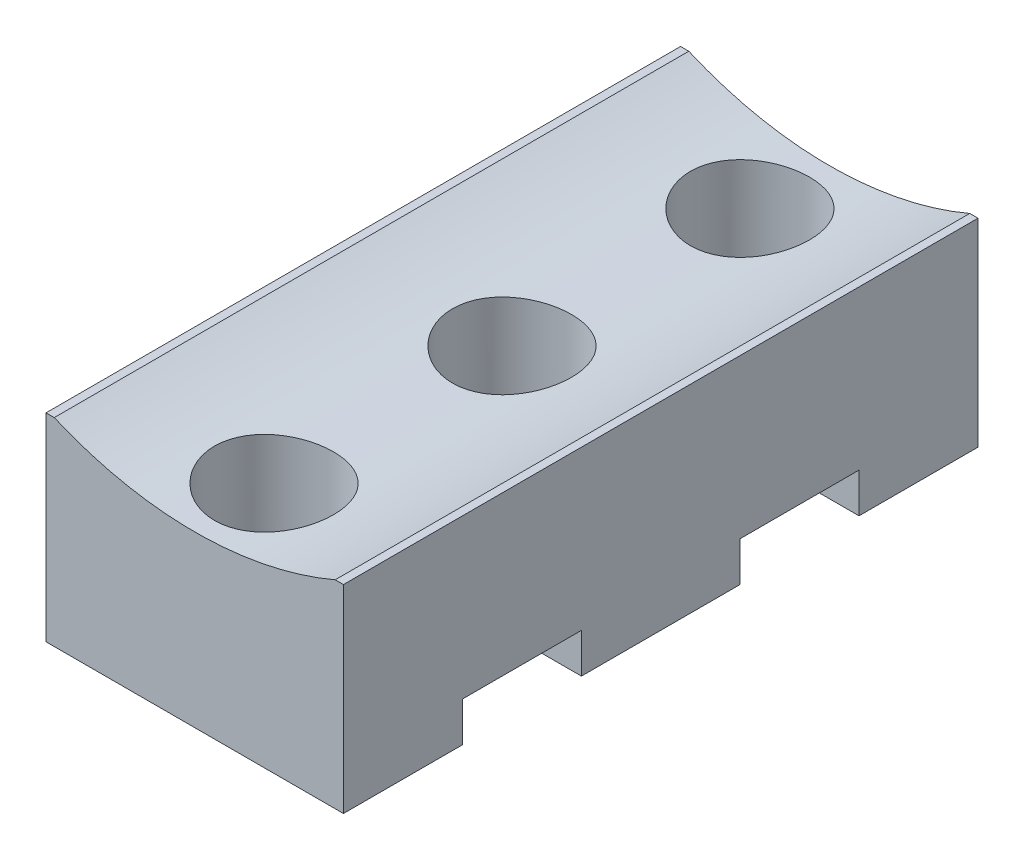
ISO-10303-21;
HEADER;
FILE_DESCRIPTION(('STEP AP214'),'2;1');
FILE_NAME('part.step','',(''),(''),'','','');
FILE_SCHEMA(('AUTOMOTIVE_DESIGN { 1 0 10303 214 1 1 1 1 }'));
ENDSEC;
DATA;
#1=APPLICATION_CONTEXT('core data for automotive mechanical design processes');
#2=APPLICATION_PROTOCOL_DEFINITION('international standard','automotive_design',2000,#1);
#3=PRODUCT_CONTEXT('',#1,'mechanical');
#4=PRODUCT('Part','Part','',(#3));
#5=PRODUCT_RELATED_PRODUCT_CATEGORY('part','',(#4));
#6=PRODUCT_DEFINITION_FORMATION('','',#4);
#7=PRODUCT_DEFINITION_CONTEXT('part definition',#1,'design');
#8=PRODUCT_DEFINITION('design','',#6,#7);
#9=PRODUCT_DEFINITION_SHAPE('','',#8);
#10=(LENGTH_UNIT() NAMED_UNIT(*) SI_UNIT(.MILLI.,.METRE.));
#11=(NAMED_UNIT(*) PLANE_ANGLE_UNIT() SI_UNIT($,.RADIAN.));
#12=(NAMED_UNIT(*) SI_UNIT($,.STERADIAN.) SOLID_ANGLE_UNIT());
#13=UNCERTAINTY_MEASURE_WITH_UNIT(LENGTH_MEASURE(1.E-05),#10,'distance_accuracy_value','');
#14=(GEOMETRIC_REPRESENTATION_CONTEXT(3) GLOBAL_UNCERTAINTY_ASSIGNED_CONTEXT((#13)) GLOBAL_UNIT_ASSIGNED_CONTEXT((#10,
#11,#12)) REPRESENTATION_CONTEXT('',''));
#15=CARTESIAN_POINT('',(0.,0.,0.));
#16=DIRECTION('',(0.,0.,1.));
#17=DIRECTION('',(1.,0.,0.));
#18=AXIS2_PLACEMENT_3D('',#15,#16,#17);
#19=CARTESIAN_POINT('',(-7.5,2.,-12.));
#20=DIRECTION('',(0.,0.,-1.));
#21=DIRECTION('',(-1.,0.,0.));
#22=AXIS2_PLACEMENT_3D('',#19,#20,#21);
#23=PLANE('',#22);
#24=DIRECTION('',(0.,1.,0.));
#25=VECTOR('',#24,1.);
#26=CARTESIAN_POINT('',(-7.5,10.,-12.));
#27=LINE('',#26,#25);
#28=CARTESIAN_POINT('',(-7.5,0.,-12.));
#29=VERTEX_POINT('',#28);
#30=CARTESIAN_POINT('',(-7.5,2.,-12.));
#31=VERTEX_POINT('',#30);
#32=EDGE_CURVE('E139',#29,#31,#27,.T.);
#33=ORIENTED_EDGE('',*,*,#32,.F.);
#34=DIRECTION('',(1.,0.,0.));
#35=VECTOR('',#34,1.);
#36=CARTESIAN_POINT('',(-7.5,0.,-12.));
#37=LINE('',#36,#35);
#38=CARTESIAN_POINT('',(7.5,0.,-12.));
#39=VERTEX_POINT('',#38);
#40=EDGE_CURVE('E138',#39,#29,#37,.F.);
#41=ORIENTED_EDGE('',*,*,#40,.F.);
#42=DIRECTION('',(0.,1.,0.));
#43=VECTOR('',#42,1.);
#44=CARTESIAN_POINT('',(7.5,10.,-12.));
#45=LINE('',#44,#43);
#46=CARTESIAN_POINT('',(7.5,2.,-12.));
#47=VERTEX_POINT('',#46);
#48=EDGE_CURVE('E125',#47,#39,#45,.F.);
#49=ORIENTED_EDGE('',*,*,#48,.F.);
#50=DIRECTION('',(1.,0.,0.));
#51=VECTOR('',#50,1.);
#52=CARTESIAN_POINT('',(-7.5,2.,-12.));
#53=LINE('',#52,#51);
#54=EDGE_CURVE('E166',#47,#31,#53,.F.);
#55=ORIENTED_EDGE('',*,*,#54,.T.);
#56=EDGE_LOOP('',(#33,#41,#49,#55));
#57=FACE_BOUND('',#56,.T.);
#58=ADVANCED_FACE('F17',(#57),#23,.F.);
#59=CARTESIAN_POINT('',(-7.5,0.,-32.));
#60=DIRECTION('',(0.,-1.,0.));
#61=DIRECTION('',(0.,0.,-1.));
#62=AXIS2_PLACEMENT_3D('',#59,#60,#61);
#63=PLANE('',#62);
#64=CARTESIAN_POINT('',(0.,0.,-16.));
#65=DIRECTION('',(0.,-1.,0.));
#66=DIRECTION('',(0.,0.,-1.));
#67=AXIS2_PLACEMENT_3D('',#64,#65,#66);
#68=CIRCLE('',#67,1.5);
#69=CARTESIAN_POINT('',(0.,0.,-17.5));
#70=VERTEX_POINT('',#69);
#71=EDGE_CURVE('E20',#70,#70,#68,.F.);
#72=ORIENTED_EDGE('',*,*,#71,.T.);
#73=EDGE_LOOP('',(#72));
#74=FACE_BOUND('',#73,.T.);
#75=DIRECTION('',(1.,0.,0.));
#76=VECTOR('',#75,1.);
#77=CARTESIAN_POINT('',(-7.5,0.,-20.));
#78=LINE('',#77,#76);
#79=CARTESIAN_POINT('',(-7.5,0.,-20.));
#80=VERTEX_POINT('',#79);
#81=CARTESIAN_POINT('',(7.5,0.,-20.));
#82=VERTEX_POINT('',#81);
#83=EDGE_CURVE('E143',#80,#82,#78,.T.);
#84=ORIENTED_EDGE('',*,*,#83,.T.);
#85=DIRECTION('',(0.,0.,-1.));
#86=VECTOR('',#85,1.);
#87=CARTESIAN_POINT('',(7.5,0.,-32.));
#88=LINE('',#87,#86);
#89=EDGE_CURVE('E129',#39,#82,#88,.T.);
#90=ORIENTED_EDGE('',*,*,#89,.F.);
#91=ORIENTED_EDGE('',*,*,#40,.T.);
#92=DIRECTION('',(0.,0.,1.));
#93=VECTOR('',#92,1.);
#94=CARTESIAN_POINT('',(-7.5,0.,-32.));
#95=LINE('',#94,#93);
#96=EDGE_CURVE('E194',#80,#29,#95,.T.);
#97=ORIENTED_EDGE('',*,*,#96,.F.);
#98=EDGE_LOOP('',(#84,#90,#91,#97));
#99=FACE_BOUND('',#98,.T.);
#100=ADVANCED_FACE('F145',(#74,#99),#63,.T.);
#101=CARTESIAN_POINT('',(-7.5,2.,-20.));
#102=DIRECTION('',(0.,0.,1.));
#103=DIRECTION('',(1.,0.,0.));
#104=AXIS2_PLACEMENT_3D('',#101,#102,#103);
#105=PLANE('',#104);
#106=DIRECTION('',(0.,1.,0.));
#107=VECTOR('',#106,1.);
#108=CARTESIAN_POINT('',(-7.5,10.,-20.));
#109=LINE('',#108,#107);
#110=CARTESIAN_POINT('',(-7.5,2.,-20.));
#111=VERTEX_POINT('',#110);
#112=EDGE_CURVE('E198',#111,#80,#109,.F.);
#113=ORIENTED_EDGE('',*,*,#112,.F.);
#114=DIRECTION('',(1.,0.,0.));
#115=VECTOR('',#114,1.);
#116=CARTESIAN_POINT('',(-7.5,2.,-20.));
#117=LINE('',#116,#115);
#118=CARTESIAN_POINT('',(7.5,2.,-20.));
#119=VERTEX_POINT('',#118);
#120=EDGE_CURVE('E350',#111,#119,#117,.T.);
#121=ORIENTED_EDGE('',*,*,#120,.T.);
#122=DIRECTION('',(0.,1.,0.));
#123=VECTOR('',#122,1.);
#124=CARTESIAN_POINT('',(7.5,10.,-20.));
#125=LINE('',#124,#123);
#126=EDGE_CURVE('E147',#82,#119,#125,.T.);
#127=ORIENTED_EDGE('',*,*,#126,.F.);
#128=ORIENTED_EDGE('',*,*,#83,.F.);
#129=EDGE_LOOP('',(#113,#121,#127,#128));
#130=FACE_BOUND('',#129,.T.);
#131=ADVANCED_FACE('F309',(#130),#105,.F.);
#132=CARTESIAN_POINT('',(-7.5,2.,-20.));
#133=DIRECTION('',(0.,1.,0.));
#134=DIRECTION('',(0.,0.,1.));
#135=AXIS2_PLACEMENT_3D('',#132,#133,#134);
#136=PLANE('',#135);
#137=DIRECTION('',(0.,0.,1.));
#138=VECTOR('',#137,1.);
#139=CARTESIAN_POINT('',(-7.5,2.,-32.));
#140=LINE('',#139,#138);
#141=CARTESIAN_POINT('',(-7.5,2.,-26.));
#142=VERTEX_POINT('',#141);
#143=EDGE_CURVE('E175',#142,#111,#140,.T.);
#144=ORIENTED_EDGE('',*,*,#143,.F.);
#145=DIRECTION('',(-1.,0.,0.));
#146=VECTOR('',#145,1.);
#147=CARTESIAN_POINT('',(-7.5,2.,-26.));
#148=LINE('',#147,#146);
#149=CARTESIAN_POINT('',(7.5,2.,-26.));
#150=VERTEX_POINT('',#149);
#151=EDGE_CURVE('E169',#142,#150,#148,.F.);
#152=ORIENTED_EDGE('',*,*,#151,.T.);
#153=DIRECTION('',(0.,0.,-1.));
#154=VECTOR('',#153,1.);
#155=CARTESIAN_POINT('',(7.5,2.,-32.));
#156=LINE('',#155,#154);
#157=EDGE_CURVE('E149',#119,#150,#156,.T.);
#158=ORIENTED_EDGE('',*,*,#157,.F.);
#159=ORIENTED_EDGE('',*,*,#120,.F.);
#160=EDGE_LOOP('',(#144,#152,#158,#159));
#161=FACE_BOUND('',#160,.T.);
#162=ADVANCED_FACE('F305',(#161),#136,.F.);
#163=CARTESIAN_POINT('',(-7.5,2.,-26.));
#164=DIRECTION('',(0.,0.,-1.));
#165=DIRECTION('',(-1.,0.,0.));
#166=AXIS2_PLACEMENT_3D('',#163,#164,#165);
#167=PLANE('',#166);
#168=DIRECTION('',(0.,1.,0.));
#169=VECTOR('',#168,1.);
#170=CARTESIAN_POINT('',(-7.5,10.,-26.));
#171=LINE('',#170,#169);
#172=CARTESIAN_POINT('',(-7.5,0.,-26.));
#173=VERTEX_POINT('',#172);
#174=EDGE_CURVE('E172',#173,#142,#171,.T.);
#175=ORIENTED_EDGE('',*,*,#174,.F.);
#176=DIRECTION('',(1.,0.,0.));
#177=VECTOR('',#176,1.);
#178=CARTESIAN_POINT('',(-7.5,0.,-26.));
#179=LINE('',#178,#177);
#180=CARTESIAN_POINT('',(7.5,0.,-26.));
#181=VERTEX_POINT('',#180);
#182=EDGE_CURVE('E338',#181,#173,#179,.F.);
#183=ORIENTED_EDGE('',*,*,#182,.F.);
#184=DIRECTION('',(0.,1.,0.));
#185=VECTOR('',#184,1.);
#186=CARTESIAN_POINT('',(7.5,10.,-26.));
#187=LINE('',#186,#185);
#188=EDGE_CURVE('E343',#150,#181,#187,.F.);
#189=ORIENTED_EDGE('',*,*,#188,.F.);
#190=ORIENTED_EDGE('',*,*,#151,.F.);
#191=EDGE_LOOP('',(#175,#183,#189,#190));
#192=FACE_BOUND('',#191,.T.);
#193=ADVANCED_FACE('F301',(#192),#167,.F.);
#194=CARTESIAN_POINT('',(-7.5,2.,-6.));
#195=DIRECTION('',(0.,0.,1.));
#196=DIRECTION('',(0.,-1.,0.));
#197=AXIS2_PLACEMENT_3D('',#194,#195,#196);
#198=PLANE('',#197);
#199=DIRECTION('',(0.,1.,0.));
#200=VECTOR('',#199,1.);
#201=CARTESIAN_POINT('',(-7.5,10.,-6.));
#202=LINE('',#201,#200);
#203=CARTESIAN_POINT('',(-7.5,2.,-6.));
#204=VERTEX_POINT('',#203);
#205=CARTESIAN_POINT('',(-7.5,0.,-6.));
#206=VERTEX_POINT('',#205);
#207=EDGE_CURVE('E179',#204,#206,#202,.F.);
#208=ORIENTED_EDGE('',*,*,#207,.F.);
#209=DIRECTION('',(1.,0.,0.));
#210=VECTOR('',#209,1.);
#211=CARTESIAN_POINT('',(-7.5,2.,-6.));
#212=LINE('',#211,#210);
#213=CARTESIAN_POINT('',(7.5,2.,-6.));
#214=VERTEX_POINT('',#213);
#215=EDGE_CURVE('E168',#204,#214,#212,.T.);
#216=ORIENTED_EDGE('',*,*,#215,.T.);
#217=DIRECTION('',(0.,1.,0.));
#218=VECTOR('',#217,1.);
#219=CARTESIAN_POINT('',(7.5,10.,-6.));
#220=LINE('',#219,#218);
#221=CARTESIAN_POINT('',(7.5,0.,-6.));
#222=VERTEX_POINT('',#221);
#223=EDGE_CURVE('E163',#222,#214,#220,.T.);
#224=ORIENTED_EDGE('',*,*,#223,.F.);
#225=DIRECTION('',(1.,0.,0.));
#226=VECTOR('',#225,1.);
#227=CARTESIAN_POINT('',(-7.5,0.,-6.));
#228=LINE('',#227,#226);
#229=EDGE_CURVE('E321',#206,#222,#228,.T.);
#230=ORIENTED_EDGE('',*,*,#229,.F.);
#231=EDGE_LOOP('',(#208,#216,#224,#230));
#232=FACE_BOUND('',#231,.T.);
#233=ADVANCED_FACE('F297',(#232),#198,.F.);
#234=CARTESIAN_POINT('',(-7.5,2.,-6.));
#235=DIRECTION('',(0.,1.,0.));
#236=DIRECTION('',(0.,0.,1.));
#237=AXIS2_PLACEMENT_3D('',#234,#235,#236);
#238=PLANE('',#237);
#239=DIRECTION('',(0.,0.,1.));
#240=VECTOR('',#239,1.);
#241=CARTESIAN_POINT('',(-7.5,2.,-32.));
#242=LINE('',#241,#240);
#243=EDGE_CURVE('E182',#31,#204,#242,.T.);
#244=ORIENTED_EDGE('',*,*,#243,.F.);
#245=ORIENTED_EDGE('',*,*,#54,.F.);
#246=DIRECTION('',(0.,0.,-1.));
#247=VECTOR('',#246,1.);
#248=CARTESIAN_POINT('',(7.5,2.,-32.));
#249=LINE('',#248,#247);
#250=EDGE_CURVE('E132',#214,#47,#249,.T.);
#251=ORIENTED_EDGE('',*,*,#250,.F.);
#252=ORIENTED_EDGE('',*,*,#215,.F.);
#253=EDGE_LOOP('',(#244,#245,#251,#252));
#254=FACE_BOUND('',#253,.T.);
#255=ADVANCED_FACE('F293',(#254),#238,.F.);
#256=CARTESIAN_POINT('',(0.,10.,-16.));
#257=DIRECTION('',(0.,-1.,0.));
#258=DIRECTION('',(0.,0.,-1.));
#259=AXIS2_PLACEMENT_3D('',#256,#257,#258);
#260=CYLINDRICAL_SURFACE('',#259,1.5);
#261=ORIENTED_EDGE('',*,*,#71,.F.);
#262=EDGE_LOOP('',(#261));
#263=FACE_BOUND('',#262,.T.);
#264=CARTESIAN_POINT('',(0.,4.,-16.));
#265=DIRECTION('',(0.,-1.,0.));
#266=DIRECTION('',(0.,0.,-1.));
#267=AXIS2_PLACEMENT_3D('',#264,#265,#266);
#268=CIRCLE('',#267,1.5);
#269=CARTESIAN_POINT('',(0.,4.,-17.5));
#270=VERTEX_POINT('',#269);
#271=EDGE_CURVE('E162',#270,#270,#268,.T.);
#272=ORIENTED_EDGE('',*,*,#271,.F.);
#273=EDGE_LOOP('',(#272));
#274=FACE_BOUND('',#273,.T.);
#275=ADVANCED_FACE('F289',(#263,#274),#260,.F.);
#276=CARTESIAN_POINT('',(0.,10.,-28.));
#277=DIRECTION('',(0.,-1.,0.));
#278=DIRECTION('',(0.,0.,-1.));
#279=AXIS2_PLACEMENT_3D('',#276,#277,#278);
#280=CYLINDRICAL_SURFACE('',#279,1.5);
#281=CARTESIAN_POINT('',(0.,0.,-28.));
#282=DIRECTION('',(0.,-1.,0.));
#283=DIRECTION('',(0.,0.,-1.));
#284=AXIS2_PLACEMENT_3D('',#281,#282,#283);
#285=CIRCLE('',#284,1.5);
#286=CARTESIAN_POINT('',(0.,0.,-29.5));
#287=VERTEX_POINT('',#286);
#288=EDGE_CURVE('E135',#287,#287,#285,.F.);
#289=ORIENTED_EDGE('',*,*,#288,.F.);
#290=EDGE_LOOP('',(#289));
#291=FACE_BOUND('',#290,.T.);
#292=CARTESIAN_POINT('',(0.,4.,-28.));
#293=DIRECTION('',(0.,-1.,0.));
#294=DIRECTION('',(0.,0.,-1.));
#295=AXIS2_PLACEMENT_3D('',#292,#293,#294);
#296=CIRCLE('',#295,1.5);
#297=CARTESIAN_POINT('',(0.,4.,-29.5));
#298=VERTEX_POINT('',#297);
#299=EDGE_CURVE('E420',#298,#298,#296,.T.);
#300=ORIENTED_EDGE('',*,*,#299,.F.);
#301=EDGE_LOOP('',(#300));
#302=FACE_BOUND('',#301,.T.);
#303=ADVANCED_FACE('F285',(#291,#302),#280,.F.);
#304=CARTESIAN_POINT('',(0.,10.,-4.));
#305=DIRECTION('',(0.,-1.,0.));
#306=DIRECTION('',(0.,0.,-1.));
#307=AXIS2_PLACEMENT_3D('',#304,#305,#306);
#308=CYLINDRICAL_SURFACE('',#307,1.5);
#309=CARTESIAN_POINT('',(0.,0.,-4.));
#310=DIRECTION('',(0.,-1.,0.));
#311=DIRECTION('',(0.,0.,-1.));
#312=AXIS2_PLACEMENT_3D('',#309,#310,#311);
#313=CIRCLE('',#312,1.5);
#314=CARTESIAN_POINT('',(0.,0.,-5.5));
#315=VERTEX_POINT('',#314);
#316=EDGE_CURVE('E176',#315,#315,#313,.F.);
#317=ORIENTED_EDGE('',*,*,#316,.F.);
#318=EDGE_LOOP('',(#317));
#319=FACE_BOUND('',#318,.T.);
#320=CARTESIAN_POINT('',(0.,4.,-4.));
#321=DIRECTION('',(0.,-1.,0.));
#322=DIRECTION('',(0.,0.,-1.));
#323=AXIS2_PLACEMENT_3D('',#320,#321,#322);
#324=CIRCLE('',#323,1.5);
#325=CARTESIAN_POINT('',(0.,4.,-5.5));
#326=VERTEX_POINT('',#325);
#327=EDGE_CURVE('E417',#326,#326,#324,.T.);
#328=ORIENTED_EDGE('',*,*,#327,.F.);
#329=EDGE_LOOP('',(#328));
#330=FACE_BOUND('',#329,.T.);
#331=ADVANCED_FACE('F281',(#319,#330),#308,.F.);
#332=CARTESIAN_POINT('',(-7.5,0.,-32.));
#333=DIRECTION('',(0.,-1.,0.));
#334=DIRECTION('',(0.,0.,-1.));
#335=AXIS2_PLACEMENT_3D('',#332,#333,#334);
#336=PLANE('',#335);
#337=ORIENTED_EDGE('',*,*,#316,.T.);
#338=EDGE_LOOP('',(#337));
#339=FACE_BOUND('',#338,.T.);
#340=ORIENTED_EDGE('',*,*,#229,.T.);
#341=DIRECTION('',(0.,0.,-1.));
#342=VECTOR('',#341,1.);
#343=CARTESIAN_POINT('',(7.5,0.,-32.));
#344=LINE('',#343,#342);
#345=CARTESIAN_POINT('',(7.5,0.,0.));
#346=VERTEX_POINT('',#345);
#347=EDGE_CURVE('E335',#346,#222,#344,.T.);
#348=ORIENTED_EDGE('',*,*,#347,.F.);
#349=DIRECTION('',(1.,0.,0.));
#350=VECTOR('',#349,1.);
#351=CARTESIAN_POINT('',(-7.5,0.,0.));
#352=LINE('',#351,#350);
#353=CARTESIAN_POINT('',(-7.5,0.,0.));
#354=VERTEX_POINT('',#353);
#355=EDGE_CURVE('E397',#354,#346,#352,.T.);
#356=ORIENTED_EDGE('',*,*,#355,.F.);
#357=DIRECTION('',(0.,0.,1.));
#358=VECTOR('',#357,1.);
#359=CARTESIAN_POINT('',(-7.5,0.,-32.));
#360=LINE('',#359,#358);
#361=EDGE_CURVE('E181',#206,#354,#360,.T.);
#362=ORIENTED_EDGE('',*,*,#361,.F.);
#363=EDGE_LOOP('',(#340,#348,#356,#362));
#364=FACE_BOUND('',#363,.T.);
#365=ADVANCED_FACE('F277',(#339,#364),#336,.T.);
#366=CARTESIAN_POINT('',(-7.5,10.,-32.));
#367=DIRECTION('',(-1.,0.,0.));
#368=DIRECTION('',(0.,0.,1.));
#369=AXIS2_PLACEMENT_3D('',#366,#367,#368);
#370=PLANE('',#369);
#371=DIRECTION('',(0.,1.,0.));
#372=VECTOR('',#371,1.);
#373=CARTESIAN_POINT('',(-7.5,0.,-32.));
#374=LINE('',#373,#372);
#375=CARTESIAN_POINT('',(-7.5,10.,-32.));
#376=VERTEX_POINT('',#375);
#377=CARTESIAN_POINT('',(-7.5,0.,-32.));
#378=VERTEX_POINT('',#377);
#379=EDGE_CURVE('E383',#376,#378,#374,.F.);
#380=ORIENTED_EDGE('',*,*,#379,.T.);
#381=DIRECTION('',(0.,0.,-1.));
#382=VECTOR('',#381,1.);
#383=CARTESIAN_POINT('',(-7.5,0.,-32.));
#384=LINE('',#383,#382);
#385=EDGE_CURVE('E340',#173,#378,#384,.T.);
#386=ORIENTED_EDGE('',*,*,#385,.F.);
#387=ORIENTED_EDGE('',*,*,#174,.T.);
#388=ORIENTED_EDGE('',*,*,#143,.T.);
#389=ORIENTED_EDGE('',*,*,#112,.T.);
#390=ORIENTED_EDGE('',*,*,#96,.T.);
#391=ORIENTED_EDGE('',*,*,#32,.T.);
#392=ORIENTED_EDGE('',*,*,#243,.T.);
#393=ORIENTED_EDGE('',*,*,#207,.T.);
#394=ORIENTED_EDGE('',*,*,#361,.T.);
#395=DIRECTION('',(0.,1.,0.));
#396=VECTOR('',#395,1.);
#397=CARTESIAN_POINT('',(-7.5,0.,0.));
#398=LINE('',#397,#396);
#399=CARTESIAN_POINT('',(-7.5,10.,0.));
#400=VERTEX_POINT('',#399);
#401=EDGE_CURVE('E400',#400,#354,#398,.F.);
#402=ORIENTED_EDGE('',*,*,#401,.F.);
#403=DIRECTION('',(0.,0.,1.));
#404=VECTOR('',#403,1.);
#405=CARTESIAN_POINT('',(-7.5,10.,-32.));
#406=LINE('',#405,#404);
#407=EDGE_CURVE('E394',#376,#400,#406,.T.);
#408=ORIENTED_EDGE('',*,*,#407,.F.);
#409=EDGE_LOOP('',(#380,#386,#387,#388,#389,#390,#391,#392,#393,#394,#402,#408));
#410=FACE_BOUND('',#409,.T.);
#411=ADVANCED_FACE('F273',(#410),#370,.T.);
#412=CARTESIAN_POINT('',(-7.5,0.,-32.));
#413=DIRECTION('',(0.,-1.,0.));
#414=DIRECTION('',(0.,0.,-1.));
#415=AXIS2_PLACEMENT_3D('',#412,#413,#414);
#416=PLANE('',#415);
#417=ORIENTED_EDGE('',*,*,#288,.T.);
#418=EDGE_LOOP('',(#417));
#419=FACE_BOUND('',#418,.T.);
#420=ORIENTED_EDGE('',*,*,#182,.T.);
#421=ORIENTED_EDGE('',*,*,#385,.T.);
#422=DIRECTION('',(1.,0.,0.));
#423=VECTOR('',#422,1.);
#424=CARTESIAN_POINT('',(-7.5,0.,-32.));
#425=LINE('',#424,#423);
#426=CARTESIAN_POINT('',(7.5,0.,-32.));
#427=VERTEX_POINT('',#426);
#428=EDGE_CURVE('E373',#378,#427,#425,.T.);
#429=ORIENTED_EDGE('',*,*,#428,.T.);
#430=DIRECTION('',(0.,0.,-1.));
#431=VECTOR('',#430,1.);
#432=CARTESIAN_POINT('',(7.5,0.,-32.));
#433=LINE('',#432,#431);
#434=EDGE_CURVE('E345',#181,#427,#433,.T.);
#435=ORIENTED_EDGE('',*,*,#434,.F.);
#436=EDGE_LOOP('',(#420,#421,#429,#435));
#437=FACE_BOUND('',#436,.T.);
#438=ADVANCED_FACE('F270',(#419,#437),#416,.T.);
#439=CARTESIAN_POINT('',(7.5,10.,-32.));
#440=DIRECTION('',(1.,0.,0.));
#441=DIRECTION('',(0.,0.,-1.));
#442=AXIS2_PLACEMENT_3D('',#439,#440,#441);
#443=PLANE('',#442);
#444=ORIENTED_EDGE('',*,*,#223,.T.);
#445=ORIENTED_EDGE('',*,*,#250,.T.);
#446=ORIENTED_EDGE('',*,*,#48,.T.);
#447=ORIENTED_EDGE('',*,*,#89,.T.);
#448=ORIENTED_EDGE('',*,*,#126,.T.);
#449=ORIENTED_EDGE('',*,*,#157,.T.);
#450=ORIENTED_EDGE('',*,*,#188,.T.);
#451=ORIENTED_EDGE('',*,*,#434,.T.);
#452=DIRECTION('',(0.,1.,0.));
#453=VECTOR('',#452,1.);
#454=CARTESIAN_POINT('',(7.5,0.,-32.));
#455=LINE('',#454,#453);
#456=CARTESIAN_POINT('',(7.5,10.,-32.));
#457=VERTEX_POINT('',#456);
#458=EDGE_CURVE('E382',#427,#457,#455,.T.);
#459=ORIENTED_EDGE('',*,*,#458,.T.);
#460=DIRECTION('',(0.,0.,1.));
#461=VECTOR('',#460,1.);
#462=CARTESIAN_POINT('',(7.5,10.,-32.));
#463=LINE('',#462,#461);
#464=CARTESIAN_POINT('',(7.5,10.,0.));
#465=VERTEX_POINT('',#464);
#466=EDGE_CURVE('E53',#465,#457,#463,.F.);
#467=ORIENTED_EDGE('',*,*,#466,.F.);
#468=DIRECTION('',(0.,1.,0.));
#469=VECTOR('',#468,1.);
#470=CARTESIAN_POINT('',(7.5,0.,0.));
#471=LINE('',#470,#469);
#472=EDGE_CURVE('E403',#346,#465,#471,.T.);
#473=ORIENTED_EDGE('',*,*,#472,.F.);
#474=ORIENTED_EDGE('',*,*,#347,.T.);
#475=EDGE_LOOP('',(#444,#445,#446,#447,#448,#449,#450,#451,#459,#467,#473,#474));
#476=FACE_BOUND('',#475,.T.);
#477=ADVANCED_FACE('F127',(#476),#443,.T.);
#478=CARTESIAN_POINT('',(0.,4.,-16.));
#479=DIRECTION('',(0.,1.,0.));
#480=DIRECTION('',(0.,0.,1.));
#481=AXIS2_PLACEMENT_3D('',#478,#479,#480);
#482=PLANE('',#481);
#483=CARTESIAN_POINT('',(0.,4.,-16.));
#484=DIRECTION('',(0.,1.,0.));
#485=DIRECTION('',(0.,0.,1.));
#486=AXIS2_PLACEMENT_3D('',#483,#484,#485);
#487=CIRCLE('',#486,3.);
#488=CARTESIAN_POINT('',(0.,4.,-13.));
#489=VERTEX_POINT('',#488);
#490=EDGE_CURVE('E434',#489,#489,#487,.T.);
#491=ORIENTED_EDGE('',*,*,#490,.T.);
#492=EDGE_LOOP('',(#491));
#493=FACE_BOUND('',#492,.T.);
#494=ORIENTED_EDGE('',*,*,#271,.T.);
#495=EDGE_LOOP('',(#494));
#496=FACE_BOUND('',#495,.T.);
#497=ADVANCED_FACE('F263',(#493,#496),#482,.T.);
#498=CARTESIAN_POINT('',(0.,4.,-28.));
#499=DIRECTION('',(0.,1.,0.));
#500=DIRECTION('',(0.,0.,1.));
#501=AXIS2_PLACEMENT_3D('',#498,#499,#500);
#502=PLANE('',#501);
#503=CARTESIAN_POINT('',(0.,4.,-28.));
#504=DIRECTION('',(0.,1.,0.));
#505=DIRECTION('',(0.,0.,1.));
#506=AXIS2_PLACEMENT_3D('',#503,#504,#505);
#507=CIRCLE('',#506,3.);
#508=CARTESIAN_POINT('',(0.,4.,-25.));
#509=VERTEX_POINT('',#508);
#510=EDGE_CURVE('E450',#509,#509,#507,.T.);
#511=ORIENTED_EDGE('',*,*,#510,.T.);
#512=EDGE_LOOP('',(#511));
#513=FACE_BOUND('',#512,.T.);
#514=ORIENTED_EDGE('',*,*,#299,.T.);
#515=EDGE_LOOP('',(#514));
#516=FACE_BOUND('',#515,.T.);
#517=ADVANCED_FACE('F259',(#513,#516),#502,.T.);
#518=CARTESIAN_POINT('',(0.,4.,-4.));
#519=DIRECTION('',(0.,1.,0.));
#520=DIRECTION('',(0.,0.,1.));
#521=AXIS2_PLACEMENT_3D('',#518,#519,#520);
#522=PLANE('',#521);
#523=CARTESIAN_POINT('',(0.,4.,-4.));
#524=DIRECTION('',(0.,1.,0.));
#525=DIRECTION('',(0.,0.,1.));
#526=AXIS2_PLACEMENT_3D('',#523,#524,#525);
#527=CIRCLE('',#526,3.);
#528=CARTESIAN_POINT('',(0.,4.,-1.));
#529=VERTEX_POINT('',#528);
#530=EDGE_CURVE('E448',#529,#529,#527,.T.);
#531=ORIENTED_EDGE('',*,*,#530,.T.);
#532=EDGE_LOOP('',(#531));
#533=FACE_BOUND('',#532,.T.);
#534=ORIENTED_EDGE('',*,*,#327,.T.);
#535=EDGE_LOOP('',(#534));
#536=FACE_BOUND('',#535,.T.);
#537=ADVANCED_FACE('F255',(#533,#536),#522,.T.);
#538=CARTESIAN_POINT('',(-7.5,0.,0.));
#539=DIRECTION('',(0.,0.,1.));
#540=DIRECTION('',(1.,0.,0.));
#541=AXIS2_PLACEMENT_3D('',#538,#539,#540);
#542=PLANE('',#541);
#543=ORIENTED_EDGE('',*,*,#401,.T.);
#544=ORIENTED_EDGE('',*,*,#355,.T.);
#545=ORIENTED_EDGE('',*,*,#472,.T.);
#546=DIRECTION('',(1.,0.,0.));
#547=VECTOR('',#546,1.);
#548=CARTESIAN_POINT('',(-7.5,10.,0.));
#549=LINE('',#548,#547);
#550=CARTESIAN_POINT('',(7.08413982391358,10.,0.));
#551=VERTEX_POINT('',#550);
#552=EDGE_CURVE('E432',#551,#465,#549,.T.);
#553=ORIENTED_EDGE('',*,*,#552,.F.);
#554=CARTESIAN_POINT('',(0.,26.5473551649574,0.));
#555=DIRECTION('',(0.,0.,1.));
#556=DIRECTION('',(1.,0.,0.));
#557=AXIS2_PLACEMENT_3D('',#554,#555,#556);
#558=CIRCLE('',#557,18.);
#559=CARTESIAN_POINT('',(-7.0841398239136,10.,0.));
#560=VERTEX_POINT('',#559);
#561=EDGE_CURVE('E46',#551,#560,#558,.F.);
#562=ORIENTED_EDGE('',*,*,#561,.T.);
#563=DIRECTION('',(1.,0.,0.));
#564=VECTOR('',#563,1.);
#565=CARTESIAN_POINT('',(-7.5,10.,0.));
#566=LINE('',#565,#564);
#567=EDGE_CURVE('E396',#400,#560,#566,.T.);
#568=ORIENTED_EDGE('',*,*,#567,.F.);
#569=EDGE_LOOP('',(#543,#544,#545,#553,#562,#568));
#570=FACE_BOUND('',#569,.T.);
#571=ADVANCED_FACE('F251',(#570),#542,.T.);
#572=CARTESIAN_POINT('',(-7.5,10.,-32.));
#573=DIRECTION('',(0.,1.,0.));
#574=DIRECTION('',(0.,0.,1.));
#575=AXIS2_PLACEMENT_3D('',#572,#573,#574);
#576=PLANE('',#575);
#577=DIRECTION('',(0.,0.,1.));
#578=VECTOR('',#577,1.);
#579=CARTESIAN_POINT('',(-7.08413982391361,10.,-32.));
#580=LINE('',#579,#578);
#581=CARTESIAN_POINT('',(-7.08413982391362,10.,-32.));
#582=VERTEX_POINT('',#581);
#583=EDGE_CURVE('E447',#560,#582,#580,.F.);
#584=ORIENTED_EDGE('',*,*,#583,.T.);
#585=DIRECTION('',(1.,0.,0.));
#586=VECTOR('',#585,1.);
#587=CARTESIAN_POINT('',(-7.5,10.,-32.));
#588=LINE('',#587,#586);
#589=EDGE_CURVE('E391',#582,#376,#588,.F.);
#590=ORIENTED_EDGE('',*,*,#589,.T.);
#591=ORIENTED_EDGE('',*,*,#407,.T.);
#592=ORIENTED_EDGE('',*,*,#567,.T.);
#593=EDGE_LOOP('',(#584,#590,#591,#592));
#594=FACE_BOUND('',#593,.T.);
#595=ADVANCED_FACE('F247',(#594),#576,.T.);
#596=CARTESIAN_POINT('',(-7.5,0.,-32.));
#597=DIRECTION('',(0.,0.,1.));
#598=DIRECTION('',(1.,0.,0.));
#599=AXIS2_PLACEMENT_3D('',#596,#597,#598);
#600=PLANE('',#599);
#601=DIRECTION('',(1.,0.,0.));
#602=VECTOR('',#601,1.);
#603=CARTESIAN_POINT('',(-7.5,10.,-32.));
#604=LINE('',#603,#602);
#605=CARTESIAN_POINT('',(7.08413982391358,10.,-32.));
#606=VERTEX_POINT('',#605);
#607=EDGE_CURVE('E35',#457,#606,#604,.F.);
#608=ORIENTED_EDGE('',*,*,#607,.F.);
#609=ORIENTED_EDGE('',*,*,#458,.F.);
#610=ORIENTED_EDGE('',*,*,#428,.F.);
#611=ORIENTED_EDGE('',*,*,#379,.F.);
#612=ORIENTED_EDGE('',*,*,#589,.F.);
#613=CARTESIAN_POINT('',(0.,26.5473551649574,-32.));
#614=DIRECTION('',(0.,0.,1.));
#615=DIRECTION('',(1.,0.,0.));
#616=AXIS2_PLACEMENT_3D('',#613,#614,#615);
#617=CIRCLE('',#616,18.);
#618=EDGE_CURVE('E232',#582,#606,#617,.T.);
#619=ORIENTED_EDGE('',*,*,#618,.T.);
#620=EDGE_LOOP('',(#608,#609,#610,#611,#612,#619));
#621=FACE_BOUND('',#620,.T.);
#622=ADVANCED_FACE('F244',(#621),#600,.F.);
#623=CARTESIAN_POINT('',(-7.5,10.,-32.));
#624=DIRECTION('',(0.,1.,0.));
#625=DIRECTION('',(0.,0.,1.));
#626=AXIS2_PLACEMENT_3D('',#623,#624,#625);
#627=PLANE('',#626);
#628=DIRECTION('',(0.,0.,1.));
#629=VECTOR('',#628,1.);
#630=CARTESIAN_POINT('',(7.08413982391358,9.99999999999999,-32.));
#631=LINE('',#630,#629);
#632=EDGE_CURVE('E231',#606,#551,#631,.T.);
#633=ORIENTED_EDGE('',*,*,#632,.T.);
#634=ORIENTED_EDGE('',*,*,#552,.T.);
#635=ORIENTED_EDGE('',*,*,#466,.T.);
#636=ORIENTED_EDGE('',*,*,#607,.T.);
#637=EDGE_LOOP('',(#633,#634,#635,#636));
#638=FACE_BOUND('',#637,.T.);
#639=ADVANCED_FACE('F239',(#638),#627,.T.);
#640=CARTESIAN_POINT('',(0.,4.,-16.));
#641=DIRECTION('',(0.,1.,0.));
#642=DIRECTION('',(0.,0.,1.));
#643=AXIS2_PLACEMENT_3D('',#640,#641,#642);
#644=CYLINDRICAL_SURFACE('',#643,3.);
#645=ORIENTED_EDGE('',*,*,#490,.F.);
#646=EDGE_LOOP('',(#645));
#647=FACE_BOUND('',#646,.T.);
#648=CARTESIAN_POINT('',(0.,8.54735516495738,-19.));
#649=CARTESIAN_POINT('',(-0.16710542284323,8.54735834709135,-18.9999923028094));
#650=CARTESIAN_POINT('',(-0.334424042029189,8.54970844693161,-18.9859787480497));
#651=CARTESIAN_POINT('',(-0.664494045351389,8.5588633976651,-18.9302838356979));
#652=CARTESIAN_POINT('',(-0.82723545879622,8.56567729023721,-18.8885463191645));
#653=CARTESIAN_POINT('',(-1.14314119468437,8.58299548491677,-18.7786942730759));
#654=CARTESIAN_POINT('',(-1.29631716297547,8.59349519215987,-18.7106125743309));
#655=CARTESIAN_POINT('',(-1.58900766651183,8.61702780400564,-18.5500813555517));
#656=CARTESIAN_POINT('',(-1.72852726627542,8.63005976411898,-18.4576409163695));
#657=CARTESIAN_POINT('',(-1.99136333148328,8.65735500071693,-18.2500566069408));
#658=CARTESIAN_POINT('',(-2.114529001916,8.67162796373741,-18.134723043427));
#659=CARTESIAN_POINT('',(-2.33986100785765,8.69972292621787,-17.8850293919352));
#660=CARTESIAN_POINT('',(-2.44202493235993,8.7135448737481,-17.7506671224432));
#661=CARTESIAN_POINT('',(-2.62304092141885,8.73926443241489,-17.4657142160876));
#662=CARTESIAN_POINT('',(-2.70174614001876,8.75114971901201,-17.3150290857772));
#663=CARTESIAN_POINT('',(-2.83267049877272,8.77151776121109,-17.0023471178294));
#664=CARTESIAN_POINT('',(-2.88489165705092,8.78000077606084,-16.8403511431654));
#665=CARTESIAN_POINT('',(-2.96089722010099,8.79250871760757,-16.5112238066986));
#666=CARTESIAN_POINT('',(-2.98493879561113,8.79657393642382,-16.3441533937045));
#667=CARTESIAN_POINT('',(-3.0047000769294,8.79990789882542,-16.0083039470999));
#668=CARTESIAN_POINT('',(-3.0004217403074,8.79917697393678,-15.839525032392));
#669=CARTESIAN_POINT('',(-2.96387419590981,8.7930380311965,-15.5068872455603));
#670=CARTESIAN_POINT('',(-2.93189413316011,8.7876783293092,-15.3429955829882));
#671=CARTESIAN_POINT('',(-2.84130423908959,8.77296129948874,-15.0229357052052));
#672=CARTESIAN_POINT('',(-2.78269327608059,8.76360380166905,-14.8667678185313));
#673=CARTESIAN_POINT('',(-2.64020997905779,8.74189299166439,-14.5657195812624));
#674=CARTESIAN_POINT('',(-2.55621676454527,8.72952540030056,-14.4208975146872));
#675=CARTESIAN_POINT('',(-2.3654459721648,8.70319906312256,-14.1473047194026));
#676=CARTESIAN_POINT('',(-2.25866831409136,8.68924031170728,-14.0185340471996));
#677=CARTESIAN_POINT('',(-2.02380534343713,8.66109394717297,-13.7790352857002));
#678=CARTESIAN_POINT('',(-1.89547581110703,8.64690562051358,-13.6685466624349));
#679=CARTESIAN_POINT('',(-1.62190403433714,8.62004956076082,-13.4705852030582));
#680=CARTESIAN_POINT('',(-1.47665426381957,8.6073825094535,-13.3831226657101));
#681=CARTESIAN_POINT('',(-1.1731012990415,8.58497698504446,-13.2336816670763));
#682=CARTESIAN_POINT('',(-1.01477711749248,8.57524334187558,-13.1717451741364));
#683=CARTESIAN_POINT('',(-0.689983674346995,8.55985365352399,-13.0755345141578));
#684=CARTESIAN_POINT('',(-0.523532375544592,8.55418901506511,-13.0412020321636));
#685=CARTESIAN_POINT('',(-0.296563335675103,8.54970055904292,-13.0141004072232));
#686=CARTESIAN_POINT('',(-0.237385086219341,8.54882291154432,-13.0088170139648));
#687=CARTESIAN_POINT('',(-0.118813543546896,8.54764964849881,-13.0017654403841));
#688=CARTESIAN_POINT('',(-0.0594202501510433,8.54735403343697,-12.9999972629913));
#689=CARTESIAN_POINT('',(0.167105422843226,8.54735834709135,-13.0000076971906));
#690=CARTESIAN_POINT('',(0.334424042029186,8.54970844693161,-13.0140212519503));
#691=CARTESIAN_POINT('',(0.664494045351385,8.5588633976651,-13.0697161643021));
#692=CARTESIAN_POINT('',(0.827235458796217,8.56567729023722,-13.1114536808355));
#693=CARTESIAN_POINT('',(1.14314119468437,8.58299548491677,-13.2213057269241));
#694=CARTESIAN_POINT('',(1.29631716297546,8.59349519215987,-13.2893874256691));
#695=CARTESIAN_POINT('',(1.58900766651183,8.61702780400564,-13.4499186444483));
#696=CARTESIAN_POINT('',(1.72852726627542,8.63005976411898,-13.5423590836305));
#697=CARTESIAN_POINT('',(1.99136333148328,8.65735500071694,-13.7499433930592));
#698=CARTESIAN_POINT('',(2.114529001916,8.67162796373741,-13.865276956573));
#699=CARTESIAN_POINT('',(2.33986100785765,8.69972292621787,-14.1149706080648));
#700=CARTESIAN_POINT('',(2.44202493235993,8.71354487374809,-14.2493328775568));
#701=CARTESIAN_POINT('',(2.62304092141885,8.73926443241489,-14.5342857839124));
#702=CARTESIAN_POINT('',(2.70174614001876,8.75114971901201,-14.6849709142228));
#703=CARTESIAN_POINT('',(2.83267049877271,8.77151776121109,-14.9976528821706));
#704=CARTESIAN_POINT('',(2.88489165705092,8.78000077606084,-15.1596488568346));
#705=CARTESIAN_POINT('',(2.96089722010098,8.79250871760757,-15.4887761933014));
#706=CARTESIAN_POINT('',(2.98493879561113,8.79657393642382,-15.6558466062955));
#707=CARTESIAN_POINT('',(3.0047000769294,8.79990789882542,-15.9916960529001));
#708=CARTESIAN_POINT('',(3.0004217403074,8.79917697393678,-16.160474967608));
#709=CARTESIAN_POINT('',(2.96387419590981,8.79303803119651,-16.4931127544397));
#710=CARTESIAN_POINT('',(2.93189413316011,8.78767832930921,-16.6570044170118));
#711=CARTESIAN_POINT('',(2.84130423908959,8.77296129948875,-16.9770642947948));
#712=CARTESIAN_POINT('',(2.78269327608059,8.76360380166905,-17.1332321814687));
#713=CARTESIAN_POINT('',(2.64020997905779,8.74189299166439,-17.4342804187376));
#714=CARTESIAN_POINT('',(2.55621676454528,8.72952540030056,-17.5791024853128));
#715=CARTESIAN_POINT('',(2.36544597216481,8.70319906312256,-17.8526952805974));
#716=CARTESIAN_POINT('',(2.25866831409136,8.68924031170728,-17.9814659528004));
#717=CARTESIAN_POINT('',(2.02380534343713,8.66109394717297,-18.2209647142997));
#718=CARTESIAN_POINT('',(1.89547581110703,8.64690562051358,-18.3314533375651));
#719=CARTESIAN_POINT('',(1.62190403433714,8.62004956076081,-18.5294147969418));
#720=CARTESIAN_POINT('',(1.47665426381957,8.60738250945349,-18.6168773342899));
#721=CARTESIAN_POINT('',(1.1731012990415,8.58497698504446,-18.7663183329238));
#722=CARTESIAN_POINT('',(1.01477711749248,8.57524334187558,-18.8282548258636));
#723=CARTESIAN_POINT('',(0.689983674346993,8.55985365352399,-18.9244654858422));
#724=CARTESIAN_POINT('',(0.52353237554459,8.55418901506512,-18.9587979678364));
#725=CARTESIAN_POINT('',(0.296563335675102,8.54970055904293,-18.9858995927768));
#726=CARTESIAN_POINT('',(0.23738508621934,8.54882291154432,-18.9911829860352));
#727=CARTESIAN_POINT('',(0.118813543546895,8.54764964849881,-18.9982345596159));
#728=CARTESIAN_POINT('',(0.0594202501510406,8.54735403343697,-19.0000027370087));
#729=CARTESIAN_POINT('',(0.,8.54735516495738,-19.));
#730=B_SPLINE_CURVE_WITH_KNOTS('',3,(#648,#649,#650,#651,#652,#653,#654,#655,#656,#657,#658,
#659,#660,#661,#662,#663,#664,#665,#666,#667,#668,#669,#670,#671,#672,#673,#674,#675,#676,#677,
#678,#679,#680,#681,#682,#683,#684,#685,#686,#687,#688,#689,#690,#691,#692,#693,#694,#695,#696,
#697,#698,#699,#700,#701,#702,#703,#704,#705,#706,#707,#708,#709,#710,#711,#712,#713,#714,#715,
#716,#717,#718,#719,#720,#721,#722,#723,#724,#725,#726,#727,#728,#729),.UNSPECIFIED.,.T.,.F.,(4,
2,2,2,2,2,2,2,2,2,2,2,2,2,2,2,2,2,2,2,2,2,2,2,2,2,2,2,2,2,2,2,2,2,2,2,2,2,2,2,4),(0.,
0.501089459672944,1.00319705741744,1.5046809203961,2.00597809580989,2.51161684162916,
3.017313602549,3.52611245134674,4.03487252309976,4.53895250945664,5.04299765243215,
5.54184421638019,6.04071198094687,6.54199403236405,7.04327784841655,7.55068159301107,
8.05831189748175,8.56677351844704,9.07415814362647,9.25233809566926,9.43051819620226,
9.93160765587521,10.4337152536197,10.9351991165984,11.4364962920121,11.9421350378314,
12.4478317987513,12.956630647549,13.465390719302,13.9694707056589,14.4735158486344,
14.9723624125824,15.4712301771491,15.9725122285663,16.4737960446188,16.9811997892133,
17.488830093684,17.9972917146493,18.5046763398287,18.6828562918715,18.8610363924045),.UNSPECIFIED.);
#731=CARTESIAN_POINT('',(0.,8.54735516495738,-19.));
#732=VERTEX_POINT('',#731);
#733=EDGE_CURVE('E225',#732,#732,#730,.T.);
#734=ORIENTED_EDGE('',*,*,#733,.T.);
#735=EDGE_LOOP('',(#734));
#736=FACE_BOUND('',#735,.T.);
#737=ADVANCED_FACE('F234',(#647,#736),#644,.F.);
#738=CARTESIAN_POINT('',(0.,4.,-28.));
#739=DIRECTION('',(0.,1.,0.));
#740=DIRECTION('',(0.,0.,1.));
#741=AXIS2_PLACEMENT_3D('',#738,#739,#740);
#742=CYLINDRICAL_SURFACE('',#741,3.);
#743=ORIENTED_EDGE('',*,*,#510,.F.);
#744=EDGE_LOOP('',(#743));
#745=FACE_BOUND('',#744,.T.);
#746=CARTESIAN_POINT('',(0.,8.54735516495738,-31.));
#747=CARTESIAN_POINT('',(-0.16710542284323,8.54735834709135,-30.9999923028094));
#748=CARTESIAN_POINT('',(-0.33442404202919,8.54970844693161,-30.9859787480497));
#749=CARTESIAN_POINT('',(-0.664494045351389,8.5588633976651,-30.9302838356979));
#750=CARTESIAN_POINT('',(-0.827235458796221,8.56567729023722,-30.8885463191645));
#751=CARTESIAN_POINT('',(-1.14314119468438,8.58299548491677,-30.7786942730759));
#752=CARTESIAN_POINT('',(-1.29631716297547,8.59349519215986,-30.7106125743309));
#753=CARTESIAN_POINT('',(-1.58900766651183,8.61702780400563,-30.5500813555517));
#754=CARTESIAN_POINT('',(-1.72852726627542,8.63005976411898,-30.4576409163695));
#755=CARTESIAN_POINT('',(-1.99136333148328,8.65735500071693,-30.2500566069408));
#756=CARTESIAN_POINT('',(-2.114529001916,8.67162796373741,-30.134723043427));
#757=CARTESIAN_POINT('',(-2.33986100785765,8.69972292621787,-29.8850293919352));
#758=CARTESIAN_POINT('',(-2.44202493235993,8.7135448737481,-29.7506671224432));
#759=CARTESIAN_POINT('',(-2.62304092141885,8.73926443241489,-29.4657142160876));
#760=CARTESIAN_POINT('',(-2.70174614001876,8.75114971901201,-29.3150290857772));
#761=CARTESIAN_POINT('',(-2.83267049877272,8.77151776121109,-29.0023471178294));
#762=CARTESIAN_POINT('',(-2.88489165705092,8.78000077606084,-28.8403511431654));
#763=CARTESIAN_POINT('',(-2.96089722010098,8.79250871760757,-28.5112238066986));
#764=CARTESIAN_POINT('',(-2.98493879561113,8.79657393642382,-28.3441533937045));
#765=CARTESIAN_POINT('',(-3.0047000769294,8.79990789882542,-28.0083039470999));
#766=CARTESIAN_POINT('',(-3.0004217403074,8.79917697393678,-27.8395250323919));
#767=CARTESIAN_POINT('',(-2.96387419590981,8.7930380311965,-27.5068872455603));
#768=CARTESIAN_POINT('',(-2.93189413316011,8.7876783293092,-27.3429955829881));
#769=CARTESIAN_POINT('',(-2.84130423908958,8.77296129948874,-27.0229357052052));
#770=CARTESIAN_POINT('',(-2.78269327608058,8.76360380166905,-26.8667678185313));
#771=CARTESIAN_POINT('',(-2.64020997905778,8.74189299166439,-26.5657195812624));
#772=CARTESIAN_POINT('',(-2.55621676454527,8.72952540030056,-26.4208975146872));
#773=CARTESIAN_POINT('',(-2.3654459721648,8.70319906312256,-26.1473047194026));
#774=CARTESIAN_POINT('',(-2.25866831409136,8.68924031170728,-26.0185340471996));
#775=CARTESIAN_POINT('',(-2.02380534343713,8.66109394717297,-25.7790352857002));
#776=CARTESIAN_POINT('',(-1.89547581110703,8.64690562051358,-25.6685466624349));
#777=CARTESIAN_POINT('',(-1.62190403433714,8.62004956076081,-25.4705852030582));
#778=CARTESIAN_POINT('',(-1.47665426381957,8.60738250945349,-25.3831226657101));
#779=CARTESIAN_POINT('',(-1.17310129904149,8.58497698504446,-25.2336816670763));
#780=CARTESIAN_POINT('',(-1.01477711749248,8.57524334187558,-25.1717451741364));
#781=CARTESIAN_POINT('',(-0.689983674346989,8.55985365352399,-25.0755345141578));
#782=CARTESIAN_POINT('',(-0.523532375544587,8.55418901506512,-25.0412020321636));
#783=CARTESIAN_POINT('',(-0.2965633356751,8.54970055904293,-25.0141004072232));
#784=CARTESIAN_POINT('',(-0.237385086219339,8.54882291154432,-25.0088170139648));
#785=CARTESIAN_POINT('',(-0.118813543546896,8.54764964849881,-25.0017654403841));
#786=CARTESIAN_POINT('',(-0.0594202501510432,8.54735403343697,-24.9999972629913));
#787=CARTESIAN_POINT('',(0.167105422843226,8.54735834709135,-25.0000076971906));
#788=CARTESIAN_POINT('',(0.334424042029186,8.54970844693161,-25.0140212519503));
#789=CARTESIAN_POINT('',(0.664494045351385,8.5588633976651,-25.0697161643021));
#790=CARTESIAN_POINT('',(0.827235458796217,8.56567729023721,-25.1114536808355));
#791=CARTESIAN_POINT('',(1.14314119468437,8.58299548491677,-25.2213057269241));
#792=CARTESIAN_POINT('',(1.29631716297546,8.59349519215987,-25.2893874256691));
#793=CARTESIAN_POINT('',(1.58900766651183,8.61702780400564,-25.4499186444483));
#794=CARTESIAN_POINT('',(1.72852726627542,8.63005976411898,-25.5423590836305));
#795=CARTESIAN_POINT('',(1.99136333148328,8.65735500071693,-25.7499433930592));
#796=CARTESIAN_POINT('',(2.114529001916,8.67162796373741,-25.865276956573));
#797=CARTESIAN_POINT('',(2.33986100785764,8.69972292621787,-26.1149706080648));
#798=CARTESIAN_POINT('',(2.44202493235993,8.7135448737481,-26.2493328775568));
#799=CARTESIAN_POINT('',(2.62304092141885,8.73926443241489,-26.5342857839124));
#800=CARTESIAN_POINT('',(2.70174614001876,8.75114971901201,-26.6849709142228));
#801=CARTESIAN_POINT('',(2.83267049877271,8.77151776121109,-26.9976528821706));
#802=CARTESIAN_POINT('',(2.88489165705091,8.78000077606084,-27.1596488568346));
#803=CARTESIAN_POINT('',(2.96089722010098,8.79250871760757,-27.4887761933014));
#804=CARTESIAN_POINT('',(2.98493879561113,8.79657393642382,-27.6558466062955));
#805=CARTESIAN_POINT('',(3.0047000769294,8.79990789882542,-27.9916960529001));
#806=CARTESIAN_POINT('',(3.0004217403074,8.79917697393678,-28.1604749676081));
#807=CARTESIAN_POINT('',(2.96387419590981,8.7930380311965,-28.4931127544397));
#808=CARTESIAN_POINT('',(2.93189413316011,8.7876783293092,-28.6570044170118));
#809=CARTESIAN_POINT('',(2.84130423908958,8.77296129948874,-28.9770642947948));
#810=CARTESIAN_POINT('',(2.78269327608059,8.76360380166905,-29.1332321814687));
#811=CARTESIAN_POINT('',(2.64020997905779,8.74189299166439,-29.4342804187376));
#812=CARTESIAN_POINT('',(2.55621676454527,8.72952540030056,-29.5791024853128));
#813=CARTESIAN_POINT('',(2.3654459721648,8.70319906312256,-29.8526952805974));
#814=CARTESIAN_POINT('',(2.25866831409136,8.68924031170728,-29.9814659528004));
#815=CARTESIAN_POINT('',(2.02380534343713,8.66109394717297,-30.2209647142997));
#816=CARTESIAN_POINT('',(1.89547581110703,8.64690562051358,-30.3314533375651));
#817=CARTESIAN_POINT('',(1.62190403433714,8.62004956076082,-30.5294147969418));
#818=CARTESIAN_POINT('',(1.47665426381958,8.6073825094535,-30.6168773342899));
#819=CARTESIAN_POINT('',(1.1731012990415,8.58497698504446,-30.7663183329237));
#820=CARTESIAN_POINT('',(1.01477711749248,8.57524334187558,-30.8282548258636));
#821=CARTESIAN_POINT('',(0.689983674346996,8.55985365352399,-30.9244654858422));
#822=CARTESIAN_POINT('',(0.523532375544594,8.55418901506512,-30.9587979678364));
#823=CARTESIAN_POINT('',(0.296563335675106,8.54970055904293,-30.9858995927768));
#824=CARTESIAN_POINT('',(0.237385086219343,8.54882291154432,-30.9911829860352));
#825=CARTESIAN_POINT('',(0.118813543546896,8.54764964849881,-30.9982345596159));
#826=CARTESIAN_POINT('',(0.0594202501510413,8.54735403343697,-31.0000027370087));
#827=CARTESIAN_POINT('',(0.,8.54735516495738,-31.));
#828=B_SPLINE_CURVE_WITH_KNOTS('',3,(#746,#747,#748,#749,#750,#751,#752,#753,#754,#755,#756,
#757,#758,#759,#760,#761,#762,#763,#764,#765,#766,#767,#768,#769,#770,#771,#772,#773,#774,#775,
#776,#777,#778,#779,#780,#781,#782,#783,#784,#785,#786,#787,#788,#789,#790,#791,#792,#793,#794,
#795,#796,#797,#798,#799,#800,#801,#802,#803,#804,#805,#806,#807,#808,#809,#810,#811,#812,#813,
#814,#815,#816,#817,#818,#819,#820,#821,#822,#823,#824,#825,#826,#827),.UNSPECIFIED.,.T.,.F.,(4,
2,2,2,2,2,2,2,2,2,2,2,2,2,2,2,2,2,2,2,2,2,2,2,2,2,2,2,2,2,2,2,2,2,2,2,2,2,2,2,4),(0.,
0.501089459672945,1.00319705741744,1.5046809203961,2.00597809580989,2.51161684162916,
3.017313602549,3.52611245134674,4.03487252309976,4.53895250945664,5.04299765243215,
5.54184421638019,6.04071198094687,6.54199403236405,7.04327784841655,7.55068159301106,
8.05831189748175,8.56677351844704,9.07415814362646,9.25233809566925,9.43051819620226,
9.9316076558752,10.4337152536197,10.9351991165984,11.4364962920121,11.9421350378314,
12.4478317987513,12.956630647549,13.465390719302,13.9694707056589,14.4735158486344,
14.9723624125824,15.4712301771491,15.9725122285663,16.4737960446188,16.9811997892133,
17.488830093684,17.9972917146493,18.5046763398287,18.6828562918715,18.8610363924045),.UNSPECIFIED.);
#829=CARTESIAN_POINT('',(0.,8.54735516495738,-31.));
#830=VERTEX_POINT('',#829);
#831=EDGE_CURVE('E26',#830,#830,#828,.T.);
#832=ORIENTED_EDGE('',*,*,#831,.T.);
#833=EDGE_LOOP('',(#832));
#834=FACE_BOUND('',#833,.T.);
#835=ADVANCED_FACE('F238',(#745,#834),#742,.F.);
#836=CARTESIAN_POINT('',(0.,4.,-4.));
#837=DIRECTION('',(0.,1.,0.));
#838=DIRECTION('',(0.,0.,1.));
#839=AXIS2_PLACEMENT_3D('',#836,#837,#838);
#840=CYLINDRICAL_SURFACE('',#839,3.);
#841=ORIENTED_EDGE('',*,*,#530,.F.);
#842=EDGE_LOOP('',(#841));
#843=FACE_BOUND('',#842,.T.);
#844=CARTESIAN_POINT('',(0.,8.54735516495738,-7.));
#845=CARTESIAN_POINT('',(-0.16710542284323,8.54735834709135,-6.99999230280938));
#846=CARTESIAN_POINT('',(-0.33442404202919,8.54970844693161,-6.98597874804973));
#847=CARTESIAN_POINT('',(-0.664494045351389,8.5588633976651,-6.93028383569794));
#848=CARTESIAN_POINT('',(-0.827235458796221,8.56567729023722,-6.88854631916452));
#849=CARTESIAN_POINT('',(-1.14314119468438,8.58299548491677,-6.77869427307587));
#850=CARTESIAN_POINT('',(-1.29631716297547,8.59349519215986,-6.7106125743309));
#851=CARTESIAN_POINT('',(-1.58900766651184,8.61702780400563,-6.55008135555168));
#852=CARTESIAN_POINT('',(-1.72852726627542,8.63005976411898,-6.4576409163695));
#853=CARTESIAN_POINT('',(-1.99136333148328,8.65735500071693,-6.25005660694084));
#854=CARTESIAN_POINT('',(-2.11452900191601,8.67162796373741,-6.13472304342701));
#855=CARTESIAN_POINT('',(-2.33986100785765,8.69972292621787,-5.88502939193523));
#856=CARTESIAN_POINT('',(-2.44202493235993,8.7135448737481,-5.75066712244324));
#857=CARTESIAN_POINT('',(-2.62304092141885,8.73926443241489,-5.46571421608763));
#858=CARTESIAN_POINT('',(-2.70174614001876,8.75114971901201,-5.31502908577721));
#859=CARTESIAN_POINT('',(-2.83267049877272,8.77151776121109,-5.00234711782937));
#860=CARTESIAN_POINT('',(-2.88489165705092,8.78000077606084,-4.84035114316541));
#861=CARTESIAN_POINT('',(-2.96089722010099,8.79250871760757,-4.51122380669855));
#862=CARTESIAN_POINT('',(-2.98493879561113,8.79657393642382,-4.34415339370454));
#863=CARTESIAN_POINT('',(-3.0047000769294,8.79990789882542,-4.00830394709986));
#864=CARTESIAN_POINT('',(-3.0004217403074,8.79917697393678,-3.83952503239194));
#865=CARTESIAN_POINT('',(-2.96387419590981,8.79303803119651,-3.50688724556025));
#866=CARTESIAN_POINT('',(-2.93189413316011,8.78767832930921,-3.34299558298815));
#867=CARTESIAN_POINT('',(-2.84130423908958,8.77296129948875,-3.0229357052052));
#868=CARTESIAN_POINT('',(-2.78269327608059,8.76360380166905,-2.8667678185313));
#869=CARTESIAN_POINT('',(-2.64020997905779,8.74189299166439,-2.56571958126243));
#870=CARTESIAN_POINT('',(-2.55621676454527,8.72952540030056,-2.42089751468724));
#871=CARTESIAN_POINT('',(-2.3654459721648,8.70319906312256,-2.14730471940263));
#872=CARTESIAN_POINT('',(-2.25866831409136,8.68924031170728,-2.01853404719964));
#873=CARTESIAN_POINT('',(-2.02380534343713,8.66109394717297,-1.77903528570025));
#874=CARTESIAN_POINT('',(-1.89547581110703,8.64690562051358,-1.6685466624349));
#875=CARTESIAN_POINT('',(-1.62190403433714,8.62004956076081,-1.47058520305821));
#876=CARTESIAN_POINT('',(-1.47665426381957,8.60738250945349,-1.38312266571005));
#877=CARTESIAN_POINT('',(-1.1731012990415,8.58497698504446,-1.23368166707625));
#878=CARTESIAN_POINT('',(-1.01477711749248,8.57524334187558,-1.17174517413638));
#879=CARTESIAN_POINT('',(-0.689983674346991,8.55985365352399,-1.0755345141578));
#880=CARTESIAN_POINT('',(-0.523532375544588,8.55418901506512,-1.04120203216362));
#881=CARTESIAN_POINT('',(-0.296563335675101,8.54970055904293,-1.01410040722322));
#882=CARTESIAN_POINT('',(-0.23738508621934,8.54882291154432,-1.00881701396482));
#883=CARTESIAN_POINT('',(-0.118813543546897,8.54764964849881,-1.00176544038413));
#884=CARTESIAN_POINT('',(-0.0594202501510434,8.54735403343697,-0.999997262991321));
#885=CARTESIAN_POINT('',(0.167105422843226,8.54735834709135,-1.00000769719062));
#886=CARTESIAN_POINT('',(0.334424042029186,8.54970844693161,-1.01402125195027));
#887=CARTESIAN_POINT('',(0.664494045351386,8.5588633976651,-1.06971616430206));
#888=CARTESIAN_POINT('',(0.827235458796218,8.56567729023721,-1.11145368083548));
#889=CARTESIAN_POINT('',(1.14314119468437,8.58299548491677,-1.22130572692413));
#890=CARTESIAN_POINT('',(1.29631716297547,8.59349519215987,-1.2893874256691));
#891=CARTESIAN_POINT('',(1.58900766651183,8.61702780400564,-1.44991864444832));
#892=CARTESIAN_POINT('',(1.72852726627542,8.63005976411898,-1.5423590836305));
#893=CARTESIAN_POINT('',(1.99136333148328,8.65735500071693,-1.74994339305916));
#894=CARTESIAN_POINT('',(2.114529001916,8.67162796373741,-1.86527695657298));
#895=CARTESIAN_POINT('',(2.33986100785765,8.69972292621787,-2.11497060806477));
#896=CARTESIAN_POINT('',(2.44202493235993,8.7135448737481,-2.24933287755676));
#897=CARTESIAN_POINT('',(2.62304092141885,8.73926443241489,-2.53428578391237));
#898=CARTESIAN_POINT('',(2.70174614001876,8.75114971901201,-2.68497091422279));
#899=CARTESIAN_POINT('',(2.83267049877271,8.77151776121109,-2.99765288217063));
#900=CARTESIAN_POINT('',(2.88489165705092,8.78000077606084,-3.15964885683459));
#901=CARTESIAN_POINT('',(2.96089722010098,8.79250871760757,-3.48877619330144));
#902=CARTESIAN_POINT('',(2.98493879561113,8.79657393642382,-3.65584660629545));
#903=CARTESIAN_POINT('',(3.0047000769294,8.79990789882542,-3.99169605290014));
#904=CARTESIAN_POINT('',(3.0004217403074,8.79917697393678,-4.16047496760805));
#905=CARTESIAN_POINT('',(2.96387419590981,8.79303803119651,-4.49311275443974));
#906=CARTESIAN_POINT('',(2.93189413316011,8.78767832930921,-4.65700441701185));
#907=CARTESIAN_POINT('',(2.84130423908958,8.77296129948875,-4.9770642947948));
#908=CARTESIAN_POINT('',(2.78269327608059,8.76360380166905,-5.1332321814687));
#909=CARTESIAN_POINT('',(2.64020997905779,8.74189299166439,-5.43428041873757));
#910=CARTESIAN_POINT('',(2.55621676454527,8.72952540030056,-5.57910248531276));
#911=CARTESIAN_POINT('',(2.36544597216481,8.70319906312256,-5.85269528059737));
#912=CARTESIAN_POINT('',(2.25866831409136,8.68924031170728,-5.98146595280036));
#913=CARTESIAN_POINT('',(2.02380534343713,8.66109394717297,-6.22096471429975));
#914=CARTESIAN_POINT('',(1.89547581110703,8.64690562051358,-6.3314533375651));
#915=CARTESIAN_POINT('',(1.62190403433714,8.62004956076081,-6.52941479694179));
#916=CARTESIAN_POINT('',(1.47665426381957,8.60738250945349,-6.61687733428995));
#917=CARTESIAN_POINT('',(1.1731012990415,8.58497698504446,-6.76631833292375));
#918=CARTESIAN_POINT('',(1.01477711749248,8.57524334187558,-6.82825482586362));
#919=CARTESIAN_POINT('',(0.689983674346992,8.55985365352399,-6.9244654858422));
#920=CARTESIAN_POINT('',(0.52353237554459,8.55418901506512,-6.95879796783638));
#921=CARTESIAN_POINT('',(0.296563335675102,8.54970055904293,-6.98589959277678));
#922=CARTESIAN_POINT('',(0.23738508621934,8.54882291154432,-6.99118298603518));
#923=CARTESIAN_POINT('',(0.118813543546894,8.54764964849881,-6.99823455961587));
#924=CARTESIAN_POINT('',(0.0594202501510405,8.54735403343697,-7.00000273700868));
#925=CARTESIAN_POINT('',(0.,8.54735516495738,-7.));
#926=B_SPLINE_CURVE_WITH_KNOTS('',3,(#844,#845,#846,#847,#848,#849,#850,#851,#852,#853,#854,
#855,#856,#857,#858,#859,#860,#861,#862,#863,#864,#865,#866,#867,#868,#869,#870,#871,#872,#873,
#874,#875,#876,#877,#878,#879,#880,#881,#882,#883,#884,#885,#886,#887,#888,#889,#890,#891,#892,
#893,#894,#895,#896,#897,#898,#899,#900,#901,#902,#903,#904,#905,#906,#907,#908,#909,#910,#911,
#912,#913,#914,#915,#916,#917,#918,#919,#920,#921,#922,#923,#924,#925),.UNSPECIFIED.,.T.,.F.,(4,
2,2,2,2,2,2,2,2,2,2,2,2,2,2,2,2,2,2,2,2,2,2,2,2,2,2,2,2,2,2,2,2,2,2,2,2,2,2,2,4),(0.,
0.501089459672945,1.00319705741744,1.5046809203961,2.00597809580989,2.51161684162916,
3.017313602549,3.52611245134674,4.03487252309976,4.53895250945665,5.04299765243215,
5.54184421638019,6.04071198094687,6.54199403236405,7.04327784841655,7.55068159301107,
8.05831189748176,8.56677351844704,9.07415814362647,9.25233809566926,9.43051819620226,
9.93160765587521,10.4337152536197,10.9351991165984,11.4364962920121,11.9421350378314,
12.4478317987513,12.956630647549,13.465390719302,13.9694707056589,14.4735158486344,
14.9723624125825,15.4712301771491,15.9725122285663,16.4737960446188,16.9811997892133,
17.488830093684,17.9972917146493,18.5046763398287,18.6828562918715,18.8610363924045),.UNSPECIFIED.);
#927=CARTESIAN_POINT('',(0.,8.54735516495738,-7.));
#928=VERTEX_POINT('',#927);
#929=EDGE_CURVE('E11',#928,#928,#926,.T.);
#930=ORIENTED_EDGE('',*,*,#929,.T.);
#931=EDGE_LOOP('',(#930));
#932=FACE_BOUND('',#931,.T.);
#933=ADVANCED_FACE('F217',(#843,#932),#840,.F.);
#934=CARTESIAN_POINT('',(0.,26.5473551649574,-32.));
#935=DIRECTION('',(0.,0.,1.));
#936=DIRECTION('',(1.,0.,0.));
#937=AXIS2_PLACEMENT_3D('',#934,#935,#936);
#938=CYLINDRICAL_SURFACE('',#937,18.);
#939=ORIENTED_EDGE('',*,*,#929,.F.);
#940=EDGE_LOOP('',(#939));
#941=FACE_BOUND('',#940,.T.);
#942=ORIENTED_EDGE('',*,*,#831,.F.);
#943=EDGE_LOOP('',(#942));
#944=FACE_BOUND('',#943,.T.);
#945=ORIENTED_EDGE('',*,*,#733,.F.);
#946=EDGE_LOOP('',(#945));
#947=FACE_BOUND('',#946,.T.);
#948=ORIENTED_EDGE('',*,*,#618,.F.);
#949=ORIENTED_EDGE('',*,*,#583,.F.);
#950=ORIENTED_EDGE('',*,*,#561,.F.);
#951=ORIENTED_EDGE('',*,*,#632,.F.);
#952=EDGE_LOOP('',(#948,#949,#950,#951));
#953=FACE_BOUND('',#952,.T.);
#954=ADVANCED_FACE('F219',(#941,#944,#947,#953),#938,.F.);
#955=CLOSED_SHELL('',(#58,#100,#131,#162,#193,#233,#255,#275,#303,#331,#365,#411,#438,#477,#497,
#517,#537,#571,#595,#622,#639,#737,#835,#933,#954));
#956=MANIFOLD_SOLID_BREP('B1',#955);
#957=ADVANCED_BREP_SHAPE_REPRESENTATION('',(#18,#956),#14);
#958=SHAPE_DEFINITION_REPRESENTATION(#9,#957);
ENDSEC;
END-ISO-10303-21;
